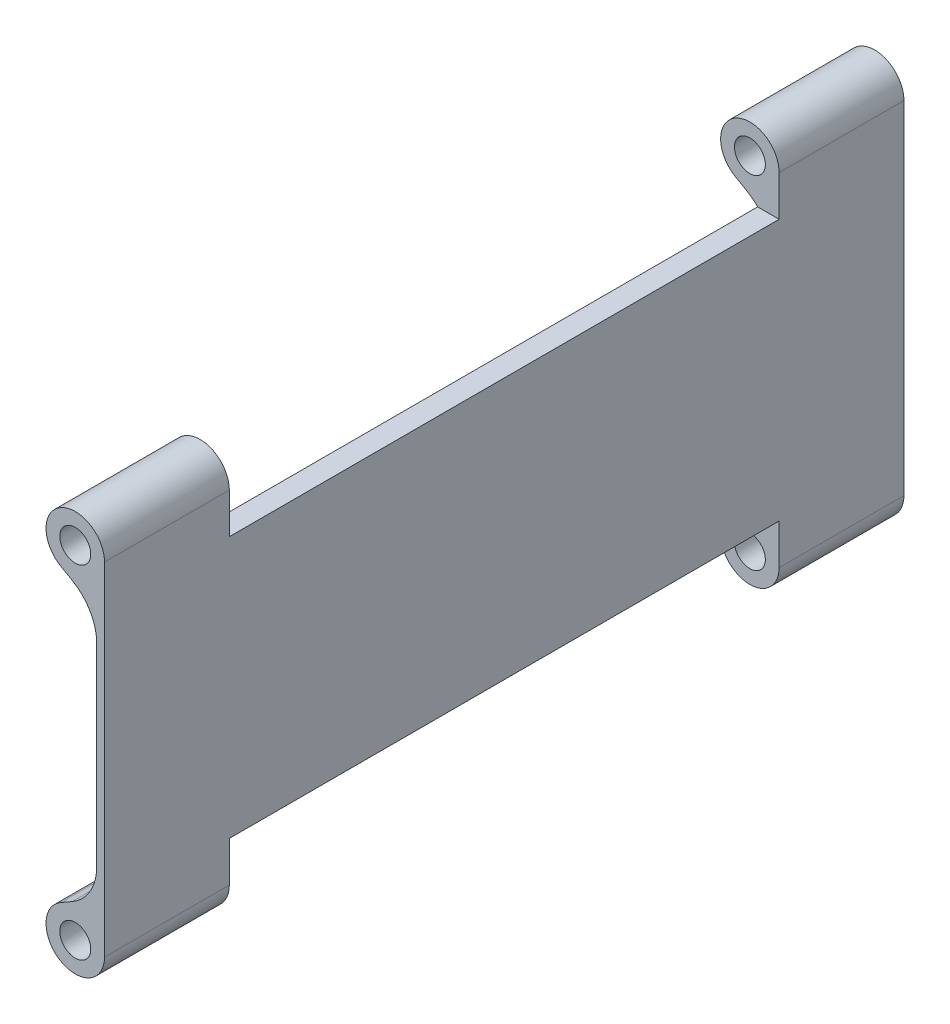
ISO-10303-21;
HEADER;
FILE_DESCRIPTION(('STEP AP214'),'2;1');
FILE_NAME('part.step','',(''),(''),'','','');
FILE_SCHEMA(('AUTOMOTIVE_DESIGN { 1 0 10303 214 1 1 1 1 }'));
ENDSEC;
DATA;
#1=APPLICATION_CONTEXT('core data for automotive mechanical design processes');
#2=APPLICATION_PROTOCOL_DEFINITION('international standard','automotive_design',2000,#1);
#3=PRODUCT_CONTEXT('',#1,'mechanical');
#4=PRODUCT('Part','Part','',(#3));
#5=PRODUCT_RELATED_PRODUCT_CATEGORY('part','',(#4));
#6=PRODUCT_DEFINITION_FORMATION('','',#4);
#7=PRODUCT_DEFINITION_CONTEXT('part definition',#1,'design');
#8=PRODUCT_DEFINITION('design','',#6,#7);
#9=PRODUCT_DEFINITION_SHAPE('','',#8);
#10=(LENGTH_UNIT() NAMED_UNIT(*) SI_UNIT(.MILLI.,.METRE.));
#11=(NAMED_UNIT(*) PLANE_ANGLE_UNIT() SI_UNIT($,.RADIAN.));
#12=(NAMED_UNIT(*) SI_UNIT($,.STERADIAN.) SOLID_ANGLE_UNIT());
#13=UNCERTAINTY_MEASURE_WITH_UNIT(LENGTH_MEASURE(1.E-05),#10,'distance_accuracy_value','');
#14=(GEOMETRIC_REPRESENTATION_CONTEXT(3) GLOBAL_UNCERTAINTY_ASSIGNED_CONTEXT((#13)) GLOBAL_UNIT_ASSIGNED_CONTEXT((#10,
#11,#12)) REPRESENTATION_CONTEXT('',''));
#15=CARTESIAN_POINT('',(0.,0.,0.));
#16=DIRECTION('',(0.,0.,1.));
#17=DIRECTION('',(1.,0.,0.));
#18=AXIS2_PLACEMENT_3D('',#15,#16,#17);
#19=CARTESIAN_POINT('',(-6.,35.09,-164.));
#20=DIRECTION('',(0.,0.,1.));
#21=DIRECTION('',(1.,0.,0.));
#22=AXIS2_PLACEMENT_3D('',#19,#20,#21);
#23=CYLINDRICAL_SURFACE('',#22,6.);
#24=DIRECTION('',(0.,0.,1.));
#25=VECTOR('',#24,1.);
#26=CARTESIAN_POINT('',(-8.98691390995378,29.8863142586697,-164.));
#27=LINE('',#26,#25);
#28=CARTESIAN_POINT('',(-8.98691390995378,29.8863142586697,-164.));
#29=VERTEX_POINT('',#28);
#30=CARTESIAN_POINT('',(-8.98691390995378,29.8863142586697,-138.395906153218));
#31=VERTEX_POINT('',#30);
#32=EDGE_CURVE('E280',#29,#31,#27,.T.);
#33=ORIENTED_EDGE('',*,*,#32,.T.);
#34=CARTESIAN_POINT('',(-6.,35.09,-138.395906153218));
#35=DIRECTION('',(0.,0.,-1.));
#36=DIRECTION('',(-1.,0.,0.));
#37=AXIS2_PLACEMENT_3D('',#34,#35,#36);
#38=CIRCLE('',#37,6.);
#39=CARTESIAN_POINT('',(0.,35.09,-138.395906153218));
#40=VERTEX_POINT('',#39);
#41=EDGE_CURVE('E194',#40,#31,#38,.F.);
#42=ORIENTED_EDGE('',*,*,#41,.F.);
#43=DIRECTION('',(0.,0.,1.));
#44=VECTOR('',#43,1.);
#45=CARTESIAN_POINT('',(0.,35.09,-164.));
#46=LINE('',#45,#44);
#47=CARTESIAN_POINT('',(0.,35.09,-164.));
#48=VERTEX_POINT('',#47);
#49=EDGE_CURVE('E268',#48,#40,#46,.T.);
#50=ORIENTED_EDGE('',*,*,#49,.F.);
#51=CARTESIAN_POINT('',(-6.,35.09,-164.));
#52=DIRECTION('',(0.,0.,1.));
#53=DIRECTION('',(1.,0.,0.));
#54=AXIS2_PLACEMENT_3D('',#51,#52,#53);
#55=CIRCLE('',#54,6.);
#56=EDGE_CURVE('E233',#48,#29,#55,.T.);
#57=ORIENTED_EDGE('',*,*,#56,.T.);
#58=EDGE_LOOP('',(#33,#42,#50,#57));
#59=FACE_BOUND('',#58,.T.);
#60=ADVANCED_FACE('F32',(#59),#23,.T.);
#61=CARTESIAN_POINT('',(-6.,-35.09,-164.));
#62=DIRECTION('',(0.,0.,1.));
#63=DIRECTION('',(1.,0.,0.));
#64=AXIS2_PLACEMENT_3D('',#61,#62,#63);
#65=CYLINDRICAL_SURFACE('',#64,6.);
#66=CARTESIAN_POINT('',(-6.,-35.09,-25.604093846782));
#67=DIRECTION('',(0.,0.,1.));
#68=DIRECTION('',(1.,0.,0.));
#69=AXIS2_PLACEMENT_3D('',#66,#67,#68);
#70=CIRCLE('',#69,6.);
#71=CARTESIAN_POINT('',(0.,-35.09,-25.604093846782));
#72=VERTEX_POINT('',#71);
#73=CARTESIAN_POINT('',(-8.98691390995378,-29.8863142586697,-25.604093846782));
#74=VERTEX_POINT('',#73);
#75=EDGE_CURVE('E215',#72,#74,#70,.F.);
#76=ORIENTED_EDGE('',*,*,#75,.F.);
#77=DIRECTION('',(0.,0.,1.));
#78=VECTOR('',#77,1.);
#79=CARTESIAN_POINT('',(0.,-35.09,-164.));
#80=LINE('',#79,#78);
#81=CARTESIAN_POINT('',(0.,-35.09,0.));
#82=VERTEX_POINT('',#81);
#83=EDGE_CURVE('E275',#72,#82,#80,.T.);
#84=ORIENTED_EDGE('',*,*,#83,.T.);
#85=CARTESIAN_POINT('',(-6.,-35.09,0.));
#86=DIRECTION('',(0.,0.,1.));
#87=DIRECTION('',(-1.,0.,0.));
#88=AXIS2_PLACEMENT_3D('',#85,#86,#87);
#89=CIRCLE('',#88,6.);
#90=CARTESIAN_POINT('',(-8.98691390995378,-29.8863142586697,0.));
#91=VERTEX_POINT('',#90);
#92=EDGE_CURVE('E263',#91,#82,#89,.T.);
#93=ORIENTED_EDGE('',*,*,#92,.F.);
#94=DIRECTION('',(0.,0.,1.));
#95=VECTOR('',#94,1.);
#96=CARTESIAN_POINT('',(-8.98691390995378,-29.8863142586697,-164.));
#97=LINE('',#96,#95);
#98=EDGE_CURVE('E279',#74,#91,#97,.T.);
#99=ORIENTED_EDGE('',*,*,#98,.F.);
#100=EDGE_LOOP('',(#76,#84,#93,#99));
#101=FACE_BOUND('',#100,.T.);
#102=ADVANCED_FACE('F332',(#101),#65,.T.);
#103=CARTESIAN_POINT('',(-1.59999999999999,-25.646228095505,-164.));
#104=DIRECTION('',(-0.497818984992298,0.867280956888389,0.));
#105=DIRECTION('',(-0.867280956888389,-0.497818984992298,0.));
#106=AXIS2_PLACEMENT_3D('',#103,#104,#105);
#107=PLANE('',#106);
#108=DIRECTION('',(0.867280956888389,0.497818984992298,0.));
#109=VECTOR('',#108,1.);
#110=CARTESIAN_POINT('',(-1.59999999999999,-25.646228095505,-25.604093846782));
#111=LINE('',#110,#109);
#112=CARTESIAN_POINT('',(-6.62181015007702,-28.5287454756913,-25.604093846782));
#113=VERTEX_POINT('',#112);
#114=EDGE_CURVE('E213',#74,#113,#111,.T.);
#115=ORIENTED_EDGE('',*,*,#114,.F.);
#116=ORIENTED_EDGE('',*,*,#98,.T.);
#117=DIRECTION('',(-0.867280956888388,-0.497818984992297,0.));
#118=VECTOR('',#117,1.);
#119=CARTESIAN_POINT('',(-1.59999999999999,-25.646228095505,0.));
#120=LINE('',#119,#118);
#121=CARTESIAN_POINT('',(-6.62181015007702,-28.5287454756913,0.));
#122=VERTEX_POINT('',#121);
#123=EDGE_CURVE('E260',#122,#91,#120,.T.);
#124=ORIENTED_EDGE('',*,*,#123,.F.);
#125=DIRECTION('',(0.,0.,1.));
#126=VECTOR('',#125,1.);
#127=CARTESIAN_POINT('',(-6.62181015007702,-28.5287454756913,-164.));
#128=LINE('',#127,#126);
#129=EDGE_CURVE('E288',#122,#113,#128,.F.);
#130=ORIENTED_EDGE('',*,*,#129,.T.);
#131=EDGE_LOOP('',(#115,#116,#124,#130));
#132=FACE_BOUND('',#131,.T.);
#133=ADVANCED_FACE('F328',(#132),#107,.T.);
#134=CARTESIAN_POINT('',(-1.59999999999999,25.646228095505,-164.));
#135=DIRECTION('',(-0.497818984992298,-0.867280956888389,0.));
#136=DIRECTION('',(0.867280956888389,-0.497818984992298,0.));
#137=AXIS2_PLACEMENT_3D('',#134,#135,#136);
#138=PLANE('',#137);
#139=DIRECTION('',(-0.867280956888389,0.497818984992298,0.));
#140=VECTOR('',#139,1.);
#141=CARTESIAN_POINT('',(-1.59999999999998,25.646228095505,-25.604093846782));
#142=LINE('',#141,#140);
#143=CARTESIAN_POINT('',(-6.62181015007702,28.5287454756913,-25.604093846782));
#144=VERTEX_POINT('',#143);
#145=CARTESIAN_POINT('',(-8.98691390995378,29.8863142586697,-25.604093846782));
#146=VERTEX_POINT('',#145);
#147=EDGE_CURVE('E199',#144,#146,#142,.T.);
#148=ORIENTED_EDGE('',*,*,#147,.F.);
#149=DIRECTION('',(0.,0.,1.));
#150=VECTOR('',#149,1.);
#151=CARTESIAN_POINT('',(-6.62181015007702,28.5287454756913,0.));
#152=LINE('',#151,#150);
#153=CARTESIAN_POINT('',(-6.62181015007702,28.5287454756913,0.));
#154=VERTEX_POINT('',#153);
#155=EDGE_CURVE('E291',#144,#154,#152,.T.);
#156=ORIENTED_EDGE('',*,*,#155,.T.);
#157=DIRECTION('',(0.867280956888388,-0.497818984992297,0.));
#158=VECTOR('',#157,1.);
#159=CARTESIAN_POINT('',(-1.59999999999999,25.646228095505,0.));
#160=LINE('',#159,#158);
#161=CARTESIAN_POINT('',(-8.98691390995378,29.8863142586697,0.));
#162=VERTEX_POINT('',#161);
#163=EDGE_CURVE('E254',#162,#154,#160,.T.);
#164=ORIENTED_EDGE('',*,*,#163,.F.);
#165=EDGE_CURVE('E251',#146,#162,#27,.T.);
#166=ORIENTED_EDGE('',*,*,#165,.F.);
#167=EDGE_LOOP('',(#148,#156,#164,#166));
#168=FACE_BOUND('',#167,.T.);
#169=ADVANCED_FACE('F346',(#168),#138,.T.);
#170=CARTESIAN_POINT('',(-6.,35.09,-164.));
#171=DIRECTION('',(0.,0.,1.));
#172=DIRECTION('',(1.,0.,0.));
#173=AXIS2_PLACEMENT_3D('',#170,#171,#172);
#174=CYLINDRICAL_SURFACE('',#173,3.175);
#175=CARTESIAN_POINT('',(-6.,35.09,-25.604093846782));
#176=DIRECTION('',(0.,0.,1.));
#177=DIRECTION('',(0.,-1.,0.));
#178=AXIS2_PLACEMENT_3D('',#175,#176,#177);
#179=CIRCLE('',#178,3.175);
#180=CARTESIAN_POINT('',(-6.,31.915,-25.604093846782));
#181=VERTEX_POINT('',#180);
#182=EDGE_CURVE('E202',#181,#181,#179,.F.);
#183=ORIENTED_EDGE('',*,*,#182,.T.);
#184=EDGE_LOOP('',(#183));
#185=FACE_BOUND('',#184,.T.);
#186=CARTESIAN_POINT('',(-6.,35.09,0.));
#187=DIRECTION('',(0.,0.,1.));
#188=DIRECTION('',(1.,0.,0.));
#189=AXIS2_PLACEMENT_3D('',#186,#187,#188);
#190=CIRCLE('',#189,3.175);
#191=CARTESIAN_POINT('',(-2.82499999999999,35.09,0.));
#192=VERTEX_POINT('',#191);
#193=EDGE_CURVE('E224',#192,#192,#190,.T.);
#194=ORIENTED_EDGE('',*,*,#193,.T.);
#195=EDGE_LOOP('',(#194));
#196=FACE_BOUND('',#195,.T.);
#197=ADVANCED_FACE('F392',(#185,#196),#174,.F.);
#198=CARTESIAN_POINT('',(-6.,-35.09,-164.));
#199=DIRECTION('',(0.,0.,1.));
#200=DIRECTION('',(1.,0.,0.));
#201=AXIS2_PLACEMENT_3D('',#198,#199,#200);
#202=CYLINDRICAL_SURFACE('',#201,3.175);
#203=CARTESIAN_POINT('',(-6.,-35.09,-25.604093846782));
#204=DIRECTION('',(0.,0.,1.));
#205=DIRECTION('',(1.,0.,0.));
#206=AXIS2_PLACEMENT_3D('',#203,#204,#205);
#207=CIRCLE('',#206,3.175);
#208=CARTESIAN_POINT('',(-2.82499999999999,-35.09,-25.604093846782));
#209=VERTEX_POINT('',#208);
#210=EDGE_CURVE('E217',#209,#209,#207,.F.);
#211=ORIENTED_EDGE('',*,*,#210,.T.);
#212=EDGE_LOOP('',(#211));
#213=FACE_BOUND('',#212,.T.);
#214=CARTESIAN_POINT('',(-6.,-35.09,0.));
#215=DIRECTION('',(0.,0.,1.));
#216=DIRECTION('',(-1.,0.,0.));
#217=AXIS2_PLACEMENT_3D('',#214,#215,#216);
#218=CIRCLE('',#217,3.175);
#219=CARTESIAN_POINT('',(-9.175,-35.09,0.));
#220=VERTEX_POINT('',#219);
#221=EDGE_CURVE('E220',#220,#220,#218,.T.);
#222=ORIENTED_EDGE('',*,*,#221,.T.);
#223=EDGE_LOOP('',(#222));
#224=FACE_BOUND('',#223,.T.);
#225=ADVANCED_FACE('F399',(#213,#224),#202,.F.);
#226=CARTESIAN_POINT('',(-6.,35.09,-25.604093846782));
#227=DIRECTION('',(0.,0.,1.));
#228=DIRECTION('',(0.,-1.,0.));
#229=AXIS2_PLACEMENT_3D('',#226,#227,#228);
#230=CIRCLE('',#229,6.);
#231=CARTESIAN_POINT('',(0.,35.09,-25.604093846782));
#232=VERTEX_POINT('',#231);
#233=EDGE_CURVE('E164',#146,#232,#230,.F.);
#234=ORIENTED_EDGE('',*,*,#233,.F.);
#235=ORIENTED_EDGE('',*,*,#165,.T.);
#236=CARTESIAN_POINT('',(-6.,35.09,0.));
#237=DIRECTION('',(0.,0.,1.));
#238=DIRECTION('',(1.,0.,0.));
#239=AXIS2_PLACEMENT_3D('',#236,#237,#238);
#240=CIRCLE('',#239,6.);
#241=CARTESIAN_POINT('',(0.,35.09,0.));
#242=VERTEX_POINT('',#241);
#243=EDGE_CURVE('E230',#242,#162,#240,.T.);
#244=ORIENTED_EDGE('',*,*,#243,.F.);
#245=EDGE_CURVE('E271',#232,#242,#46,.T.);
#246=ORIENTED_EDGE('',*,*,#245,.F.);
#247=EDGE_LOOP('',(#234,#235,#244,#246));
#248=FACE_BOUND('',#247,.T.);
#249=ADVANCED_FACE('F339',(#248),#23,.T.);
#250=CARTESIAN_POINT('',(0.,35.09,-164.));
#251=DIRECTION('',(1.,0.,0.));
#252=DIRECTION('',(0.,0.,-1.));
#253=AXIS2_PLACEMENT_3D('',#250,#251,#252);
#254=PLANE('',#253);
#255=DIRECTION('',(0.,-1.,0.));
#256=VECTOR('',#255,1.);
#257=CARTESIAN_POINT('',(0.,44.9478454916756,-25.604093846782));
#258=LINE('',#257,#256);
#259=CARTESIAN_POINT('',(0.,26.8024105782486,-25.604093846782));
#260=VERTEX_POINT('',#259);
#261=EDGE_CURVE('E157',#232,#260,#258,.T.);
#262=ORIENTED_EDGE('',*,*,#261,.F.);
#263=ORIENTED_EDGE('',*,*,#245,.T.);
#264=DIRECTION('',(0.,1.,0.));
#265=VECTOR('',#264,1.);
#266=CARTESIAN_POINT('',(0.,35.09,0.));
#267=LINE('',#266,#265);
#268=EDGE_CURVE('E237',#82,#242,#267,.T.);
#269=ORIENTED_EDGE('',*,*,#268,.F.);
#270=ORIENTED_EDGE('',*,*,#83,.F.);
#271=DIRECTION('',(0.,-1.,0.));
#272=VECTOR('',#271,1.);
#273=CARTESIAN_POINT('',(0.,-44.9478454916756,-25.604093846782));
#274=LINE('',#273,#272);
#275=CARTESIAN_POINT('',(0.,-26.8024105782486,-25.604093846782));
#276=VERTEX_POINT('',#275);
#277=EDGE_CURVE('E189',#276,#72,#274,.T.);
#278=ORIENTED_EDGE('',*,*,#277,.F.);
#279=DIRECTION('',(0.,0.,1.));
#280=VECTOR('',#279,1.);
#281=CARTESIAN_POINT('',(0.,-26.8024105782486,-25.604093846782));
#282=LINE('',#281,#280);
#283=CARTESIAN_POINT('',(0.,-26.8024105782486,-138.395906153218));
#284=VERTEX_POINT('',#283);
#285=EDGE_CURVE('E186',#284,#276,#282,.T.);
#286=ORIENTED_EDGE('',*,*,#285,.F.);
#287=DIRECTION('',(0.,1.,0.));
#288=VECTOR('',#287,1.);
#289=CARTESIAN_POINT('',(0.,-44.9478454916756,-138.395906153218));
#290=LINE('',#289,#288);
#291=CARTESIAN_POINT('',(0.,-35.09,-138.395906153218));
#292=VERTEX_POINT('',#291);
#293=EDGE_CURVE('E184',#292,#284,#290,.T.);
#294=ORIENTED_EDGE('',*,*,#293,.F.);
#295=CARTESIAN_POINT('',(0.,-35.09,-164.));
#296=VERTEX_POINT('',#295);
#297=EDGE_CURVE('E272',#296,#292,#80,.T.);
#298=ORIENTED_EDGE('',*,*,#297,.F.);
#299=DIRECTION('',(0.,1.,0.));
#300=VECTOR('',#299,1.);
#301=CARTESIAN_POINT('',(0.,35.09,-164.));
#302=LINE('',#301,#300);
#303=EDGE_CURVE('E248',#296,#48,#302,.T.);
#304=ORIENTED_EDGE('',*,*,#303,.T.);
#305=ORIENTED_EDGE('',*,*,#49,.T.);
#306=DIRECTION('',(0.,1.,0.));
#307=VECTOR('',#306,1.);
#308=CARTESIAN_POINT('',(0.,44.9478454916756,-138.395906153218));
#309=LINE('',#308,#307);
#310=CARTESIAN_POINT('',(0.,26.8024105782486,-138.395906153218));
#311=VERTEX_POINT('',#310);
#312=EDGE_CURVE('E175',#311,#40,#309,.T.);
#313=ORIENTED_EDGE('',*,*,#312,.F.);
#314=DIRECTION('',(0.,0.,-1.));
#315=VECTOR('',#314,1.);
#316=CARTESIAN_POINT('',(0.,26.8024105782486,-25.604093846782));
#317=LINE('',#316,#315);
#318=EDGE_CURVE('E168',#260,#311,#317,.T.);
#319=ORIENTED_EDGE('',*,*,#318,.F.);
#320=EDGE_LOOP('',(#262,#263,#269,#270,#278,#286,#294,#298,#304,#305,#313,#319));
#321=FACE_BOUND('',#320,.T.);
#322=ADVANCED_FACE('F177',(#321),#254,.T.);
#323=CARTESIAN_POINT('',(-6.,-35.09,-138.395906153218));
#324=DIRECTION('',(0.,0.,-1.));
#325=DIRECTION('',(-1.,0.,0.));
#326=AXIS2_PLACEMENT_3D('',#323,#324,#325);
#327=CIRCLE('',#326,6.);
#328=CARTESIAN_POINT('',(-8.98691390995378,-29.8863142586697,-138.395906153218));
#329=VERTEX_POINT('',#328);
#330=EDGE_CURVE('E208',#329,#292,#327,.F.);
#331=ORIENTED_EDGE('',*,*,#330,.F.);
#332=CARTESIAN_POINT('',(-8.98691390995378,-29.8863142586697,-164.));
#333=VERTEX_POINT('',#332);
#334=EDGE_CURVE('E276',#333,#329,#97,.T.);
#335=ORIENTED_EDGE('',*,*,#334,.F.);
#336=CARTESIAN_POINT('',(-6.,-35.09,-164.));
#337=DIRECTION('',(0.,0.,1.));
#338=DIRECTION('',(-1.,0.,0.));
#339=AXIS2_PLACEMENT_3D('',#336,#337,#338);
#340=CIRCLE('',#339,6.);
#341=EDGE_CURVE('E245',#333,#296,#340,.T.);
#342=ORIENTED_EDGE('',*,*,#341,.T.);
#343=ORIENTED_EDGE('',*,*,#297,.T.);
#344=EDGE_LOOP('',(#331,#335,#342,#343));
#345=FACE_BOUND('',#344,.T.);
#346=ADVANCED_FACE('F371',(#345),#65,.T.);
#347=DIRECTION('',(-0.867280956888389,-0.497818984992298,0.));
#348=VECTOR('',#347,1.);
#349=CARTESIAN_POINT('',(-1.59999999999999,-25.646228095505,-138.395906153218));
#350=LINE('',#349,#348);
#351=CARTESIAN_POINT('',(-6.62181015007702,-28.5287454756913,-138.395906153218));
#352=VERTEX_POINT('',#351);
#353=EDGE_CURVE('E205',#352,#329,#350,.T.);
#354=ORIENTED_EDGE('',*,*,#353,.F.);
#355=CARTESIAN_POINT('',(-6.62181015007702,-28.5287454756913,-164.));
#356=VERTEX_POINT('',#355);
#357=EDGE_CURVE('E287',#352,#356,#128,.F.);
#358=ORIENTED_EDGE('',*,*,#357,.T.);
#359=DIRECTION('',(-0.867280956888388,-0.497818984992297,0.));
#360=VECTOR('',#359,1.);
#361=CARTESIAN_POINT('',(-1.59999999999999,-25.646228095505,-164.));
#362=LINE('',#361,#360);
#363=EDGE_CURVE('E243',#356,#333,#362,.T.);
#364=ORIENTED_EDGE('',*,*,#363,.T.);
#365=ORIENTED_EDGE('',*,*,#334,.T.);
#366=EDGE_LOOP('',(#354,#358,#364,#365));
#367=FACE_BOUND('',#366,.T.);
#368=ADVANCED_FACE('F365',(#367),#107,.T.);
#369=CARTESIAN_POINT('',(-1.59999999999999,25.646228095505,-164.));
#370=DIRECTION('',(-1.,0.,0.));
#371=DIRECTION('',(0.,0.,1.));
#372=AXIS2_PLACEMENT_3D('',#369,#370,#371);
#373=PLANE('',#372);
#374=DIRECTION('',(0.,-1.,0.));
#375=VECTOR('',#374,1.);
#376=CARTESIAN_POINT('',(-1.59999999999999,25.646228095505,-164.));
#377=LINE('',#376,#375);
#378=CARTESIAN_POINT('',(-1.59999999999999,19.8559359068074,-164.));
#379=VERTEX_POINT('',#378);
#380=CARTESIAN_POINT('',(-1.59999999999999,-19.8559359068074,-164.));
#381=VERTEX_POINT('',#380);
#382=EDGE_CURVE('E240',#379,#381,#377,.T.);
#383=ORIENTED_EDGE('',*,*,#382,.T.);
#384=DIRECTION('',(0.,0.,1.));
#385=VECTOR('',#384,1.);
#386=CARTESIAN_POINT('',(-1.59999999999999,-19.8559359068074,0.));
#387=LINE('',#386,#385);
#388=CARTESIAN_POINT('',(-1.59999999999999,-19.8559359068074,0.));
#389=VERTEX_POINT('',#388);
#390=EDGE_CURVE('E284',#381,#389,#387,.T.);
#391=ORIENTED_EDGE('',*,*,#390,.T.);
#392=DIRECTION('',(0.,-1.,0.));
#393=VECTOR('',#392,1.);
#394=CARTESIAN_POINT('',(-1.59999999999999,25.646228095505,0.));
#395=LINE('',#394,#393);
#396=CARTESIAN_POINT('',(-1.59999999999999,19.8559359068074,0.));
#397=VERTEX_POINT('',#396);
#398=EDGE_CURVE('E257',#397,#389,#395,.T.);
#399=ORIENTED_EDGE('',*,*,#398,.F.);
#400=DIRECTION('',(0.,0.,1.));
#401=VECTOR('',#400,1.);
#402=CARTESIAN_POINT('',(-1.59999999999999,19.8559359068074,-164.));
#403=LINE('',#402,#401);
#404=EDGE_CURVE('E270',#397,#379,#403,.F.);
#405=ORIENTED_EDGE('',*,*,#404,.T.);
#406=EDGE_LOOP('',(#383,#391,#399,#405));
#407=FACE_BOUND('',#406,.T.);
#408=ADVANCED_FACE('F354',(#407),#373,.T.);
#409=DIRECTION('',(0.867280956888389,-0.497818984992298,0.));
#410=VECTOR('',#409,1.);
#411=CARTESIAN_POINT('',(-1.59999999999999,25.646228095505,-138.395906153218));
#412=LINE('',#411,#410);
#413=CARTESIAN_POINT('',(-6.62181015007702,28.5287454756913,-138.395906153218));
#414=VERTEX_POINT('',#413);
#415=EDGE_CURVE('E182',#31,#414,#412,.T.);
#416=ORIENTED_EDGE('',*,*,#415,.F.);
#417=ORIENTED_EDGE('',*,*,#32,.F.);
#418=DIRECTION('',(0.867280956888388,-0.497818984992297,0.));
#419=VECTOR('',#418,1.);
#420=CARTESIAN_POINT('',(-1.59999999999999,25.646228095505,-164.));
#421=LINE('',#420,#419);
#422=CARTESIAN_POINT('',(-6.62181015007702,28.5287454756913,-164.));
#423=VERTEX_POINT('',#422);
#424=EDGE_CURVE('E236',#29,#423,#421,.T.);
#425=ORIENTED_EDGE('',*,*,#424,.T.);
#426=EDGE_CURVE('E292',#423,#414,#152,.T.);
#427=ORIENTED_EDGE('',*,*,#426,.T.);
#428=EDGE_LOOP('',(#416,#417,#425,#427));
#429=FACE_BOUND('',#428,.T.);
#430=ADVANCED_FACE('F380',(#429),#138,.T.);
#431=CARTESIAN_POINT('',(-6.,35.09,-164.));
#432=DIRECTION('',(0.,0.,1.));
#433=DIRECTION('',(1.,0.,0.));
#434=AXIS2_PLACEMENT_3D('',#431,#432,#433);
#435=PLANE('',#434);
#436=CARTESIAN_POINT('',(-6.,-35.09,-164.));
#437=DIRECTION('',(0.,0.,1.));
#438=DIRECTION('',(-1.,0.,0.));
#439=AXIS2_PLACEMENT_3D('',#436,#437,#438);
#440=CIRCLE('',#439,3.175);
#441=CARTESIAN_POINT('',(-9.175,-35.09,-164.));
#442=VERTEX_POINT('',#441);
#443=EDGE_CURVE('E221',#442,#442,#440,.T.);
#444=ORIENTED_EDGE('',*,*,#443,.T.);
#445=EDGE_LOOP('',(#444));
#446=FACE_BOUND('',#445,.T.);
#447=CARTESIAN_POINT('',(-6.,35.09,-164.));
#448=DIRECTION('',(0.,0.,1.));
#449=DIRECTION('',(1.,0.,0.));
#450=AXIS2_PLACEMENT_3D('',#447,#448,#449);
#451=CIRCLE('',#450,3.175);
#452=CARTESIAN_POINT('',(-2.82499999999999,35.09,-164.));
#453=VERTEX_POINT('',#452);
#454=EDGE_CURVE('E227',#453,#453,#451,.T.);
#455=ORIENTED_EDGE('',*,*,#454,.T.);
#456=EDGE_LOOP('',(#455));
#457=FACE_BOUND('',#456,.T.);
#458=ORIENTED_EDGE('',*,*,#56,.F.);
#459=ORIENTED_EDGE('',*,*,#303,.F.);
#460=ORIENTED_EDGE('',*,*,#341,.F.);
#461=ORIENTED_EDGE('',*,*,#363,.F.);
#462=CARTESIAN_POINT('',(-11.6,-19.8559359068074,-164.));
#463=DIRECTION('',(0.,0.,1.));
#464=DIRECTION('',(1.,0.,0.));
#465=AXIS2_PLACEMENT_3D('',#462,#463,#464);
#466=CIRCLE('',#465,10.);
#467=EDGE_CURVE('E297',#356,#381,#466,.T.);
#468=ORIENTED_EDGE('',*,*,#467,.T.);
#469=ORIENTED_EDGE('',*,*,#382,.F.);
#470=CARTESIAN_POINT('',(-11.6,19.8559359068074,-164.));
#471=DIRECTION('',(0.,0.,1.));
#472=DIRECTION('',(1.,0.,0.));
#473=AXIS2_PLACEMENT_3D('',#470,#471,#472);
#474=CIRCLE('',#473,10.);
#475=EDGE_CURVE('E301',#379,#423,#474,.T.);
#476=ORIENTED_EDGE('',*,*,#475,.T.);
#477=ORIENTED_EDGE('',*,*,#424,.F.);
#478=EDGE_LOOP('',(#458,#459,#460,#461,#468,#469,#476,#477));
#479=FACE_BOUND('',#478,.T.);
#480=ADVANCED_FACE('F358',(#446,#457,#479),#435,.F.);
#481=CARTESIAN_POINT('',(-6.,35.09,0.));
#482=DIRECTION('',(0.,0.,1.));
#483=DIRECTION('',(1.,0.,0.));
#484=AXIS2_PLACEMENT_3D('',#481,#482,#483);
#485=PLANE('',#484);
#486=ORIENTED_EDGE('',*,*,#221,.F.);
#487=EDGE_LOOP('',(#486));
#488=FACE_BOUND('',#487,.T.);
#489=ORIENTED_EDGE('',*,*,#193,.F.);
#490=EDGE_LOOP('',(#489));
#491=FACE_BOUND('',#490,.T.);
#492=ORIENTED_EDGE('',*,*,#243,.T.);
#493=ORIENTED_EDGE('',*,*,#163,.T.);
#494=CARTESIAN_POINT('',(-11.6,19.8559359068074,0.));
#495=DIRECTION('',(0.,0.,1.));
#496=DIRECTION('',(1.,0.,0.));
#497=AXIS2_PLACEMENT_3D('',#494,#495,#496);
#498=CIRCLE('',#497,10.);
#499=EDGE_CURVE('E299',#154,#397,#498,.F.);
#500=ORIENTED_EDGE('',*,*,#499,.T.);
#501=ORIENTED_EDGE('',*,*,#398,.T.);
#502=CARTESIAN_POINT('',(-11.6,-19.8559359068074,0.));
#503=DIRECTION('',(0.,0.,1.));
#504=DIRECTION('',(1.,0.,0.));
#505=AXIS2_PLACEMENT_3D('',#502,#503,#504);
#506=CIRCLE('',#505,10.);
#507=EDGE_CURVE('E295',#389,#122,#506,.F.);
#508=ORIENTED_EDGE('',*,*,#507,.T.);
#509=ORIENTED_EDGE('',*,*,#123,.T.);
#510=ORIENTED_EDGE('',*,*,#92,.T.);
#511=ORIENTED_EDGE('',*,*,#268,.T.);
#512=EDGE_LOOP('',(#492,#493,#500,#501,#508,#509,#510,#511));
#513=FACE_BOUND('',#512,.T.);
#514=ADVANCED_FACE('F336',(#488,#491,#513),#485,.T.);
#515=CARTESIAN_POINT('',(-6.,35.09,-138.395906153218));
#516=DIRECTION('',(0.,0.,-1.));
#517=DIRECTION('',(-1.,0.,0.));
#518=AXIS2_PLACEMENT_3D('',#515,#516,#517);
#519=CIRCLE('',#518,3.175);
#520=CARTESIAN_POINT('',(-9.175,35.09,-138.395906153218));
#521=VERTEX_POINT('',#520);
#522=EDGE_CURVE('E196',#521,#521,#519,.F.);
#523=ORIENTED_EDGE('',*,*,#522,.T.);
#524=EDGE_LOOP('',(#523));
#525=FACE_BOUND('',#524,.T.);
#526=ORIENTED_EDGE('',*,*,#454,.F.);
#527=EDGE_LOOP('',(#526));
#528=FACE_BOUND('',#527,.T.);
#529=ADVANCED_FACE('F413',(#525,#528),#174,.F.);
#530=CARTESIAN_POINT('',(-6.,-35.09,-138.395906153218));
#531=DIRECTION('',(0.,0.,-1.));
#532=DIRECTION('',(-1.,0.,0.));
#533=AXIS2_PLACEMENT_3D('',#530,#531,#532);
#534=CIRCLE('',#533,3.175);
#535=CARTESIAN_POINT('',(-9.175,-35.09,-138.395906153218));
#536=VERTEX_POINT('',#535);
#537=EDGE_CURVE('E210',#536,#536,#534,.F.);
#538=ORIENTED_EDGE('',*,*,#537,.T.);
#539=EDGE_LOOP('',(#538));
#540=FACE_BOUND('',#539,.T.);
#541=ORIENTED_EDGE('',*,*,#443,.F.);
#542=EDGE_LOOP('',(#541));
#543=FACE_BOUND('',#542,.T.);
#544=ADVANCED_FACE('F407',(#540,#543),#202,.F.);
#545=CARTESIAN_POINT('',(-11.6,-19.8559359068074,-164.));
#546=DIRECTION('',(0.,0.,-1.));
#547=DIRECTION('',(-1.,0.,0.));
#548=AXIS2_PLACEMENT_3D('',#545,#546,#547);
#549=CYLINDRICAL_SURFACE('',#548,10.);
#550=DIRECTION('',(0.,0.,-1.));
#551=VECTOR('',#550,1.);
#552=CARTESIAN_POINT('',(-4.40649670612254,-26.8024105782486,-164.));
#553=LINE('',#552,#551);
#554=CARTESIAN_POINT('',(-4.40649670612254,-26.8024105782486,-138.395906153218));
#555=VERTEX_POINT('',#554);
#556=CARTESIAN_POINT('',(-4.40649670612254,-26.8024105782486,-25.604093846782));
#557=VERTEX_POINT('',#556);
#558=EDGE_CURVE('E40',#555,#557,#553,.F.);
#559=ORIENTED_EDGE('',*,*,#558,.T.);
#560=CARTESIAN_POINT('',(-11.6,-19.8559359068074,-25.604093846782));
#561=DIRECTION('',(0.,0.,1.));
#562=DIRECTION('',(1.,0.,0.));
#563=AXIS2_PLACEMENT_3D('',#560,#561,#562);
#564=CIRCLE('',#563,10.);
#565=EDGE_CURVE('E11',#557,#113,#564,.F.);
#566=ORIENTED_EDGE('',*,*,#565,.T.);
#567=ORIENTED_EDGE('',*,*,#129,.F.);
#568=ORIENTED_EDGE('',*,*,#507,.F.);
#569=ORIENTED_EDGE('',*,*,#390,.F.);
#570=ORIENTED_EDGE('',*,*,#467,.F.);
#571=ORIENTED_EDGE('',*,*,#357,.F.);
#572=CARTESIAN_POINT('',(-11.6,-19.8559359068074,-138.395906153218));
#573=DIRECTION('',(0.,0.,-1.));
#574=DIRECTION('',(-1.,0.,0.));
#575=AXIS2_PLACEMENT_3D('',#572,#573,#574);
#576=CIRCLE('',#575,10.);
#577=EDGE_CURVE('E309',#352,#555,#576,.F.);
#578=ORIENTED_EDGE('',*,*,#577,.T.);
#579=EDGE_LOOP('',(#559,#566,#567,#568,#569,#570,#571,#578));
#580=FACE_BOUND('',#579,.T.);
#581=ADVANCED_FACE('F313',(#580),#549,.F.);
#582=CARTESIAN_POINT('',(-11.6,19.8559359068074,-164.));
#583=DIRECTION('',(0.,0.,-1.));
#584=DIRECTION('',(-1.,0.,0.));
#585=AXIS2_PLACEMENT_3D('',#582,#583,#584);
#586=CYLINDRICAL_SURFACE('',#585,10.);
#587=ORIENTED_EDGE('',*,*,#155,.F.);
#588=CARTESIAN_POINT('',(-11.6,19.8559359068074,-25.604093846782));
#589=DIRECTION('',(0.,0.,1.));
#590=DIRECTION('',(0.,-1.,0.));
#591=AXIS2_PLACEMENT_3D('',#588,#589,#590);
#592=CIRCLE('',#591,10.);
#593=CARTESIAN_POINT('',(-4.40649670612255,26.8024105782486,-25.604093846782));
#594=VERTEX_POINT('',#593);
#595=EDGE_CURVE('E307',#144,#594,#592,.F.);
#596=ORIENTED_EDGE('',*,*,#595,.T.);
#597=DIRECTION('',(0.,0.,-1.));
#598=VECTOR('',#597,1.);
#599=CARTESIAN_POINT('',(-4.40649670612255,26.8024105782486,-164.));
#600=LINE('',#599,#598);
#601=CARTESIAN_POINT('',(-4.40649670612255,26.8024105782486,-138.395906153218));
#602=VERTEX_POINT('',#601);
#603=EDGE_CURVE('E174',#594,#602,#600,.T.);
#604=ORIENTED_EDGE('',*,*,#603,.T.);
#605=CARTESIAN_POINT('',(-11.6,19.8559359068074,-138.395906153218));
#606=DIRECTION('',(0.,0.,-1.));
#607=DIRECTION('',(-1.,0.,0.));
#608=AXIS2_PLACEMENT_3D('',#605,#606,#607);
#609=CIRCLE('',#608,10.);
#610=EDGE_CURVE('E304',#602,#414,#609,.F.);
#611=ORIENTED_EDGE('',*,*,#610,.T.);
#612=ORIENTED_EDGE('',*,*,#426,.F.);
#613=ORIENTED_EDGE('',*,*,#475,.F.);
#614=ORIENTED_EDGE('',*,*,#404,.F.);
#615=ORIENTED_EDGE('',*,*,#499,.F.);
#616=EDGE_LOOP('',(#587,#596,#604,#611,#612,#613,#614,#615));
#617=FACE_BOUND('',#616,.T.);
#618=ADVANCED_FACE('F34',(#617),#586,.F.);
#619=CARTESIAN_POINT('',(-12.,44.9478454916756,-25.604093846782));
#620=DIRECTION('',(0.,0.,1.));
#621=DIRECTION('',(0.,-1.,0.));
#622=AXIS2_PLACEMENT_3D('',#619,#620,#621);
#623=PLANE('',#622);
#624=ORIENTED_EDGE('',*,*,#233,.T.);
#625=ORIENTED_EDGE('',*,*,#261,.T.);
#626=DIRECTION('',(1.,0.,0.));
#627=VECTOR('',#626,1.);
#628=CARTESIAN_POINT('',(-12.,26.8024105782486,-25.604093846782));
#629=LINE('',#628,#627);
#630=EDGE_CURVE('E161',#594,#260,#629,.T.);
#631=ORIENTED_EDGE('',*,*,#630,.F.);
#632=ORIENTED_EDGE('',*,*,#595,.F.);
#633=ORIENTED_EDGE('',*,*,#147,.T.);
#634=EDGE_LOOP('',(#624,#625,#631,#632,#633));
#635=FACE_BOUND('',#634,.T.);
#636=ORIENTED_EDGE('',*,*,#182,.F.);
#637=EDGE_LOOP('',(#636));
#638=FACE_BOUND('',#637,.T.);
#639=ADVANCED_FACE('F159',(#635,#638),#623,.F.);
#640=CARTESIAN_POINT('',(-12.,44.9478454916756,-138.395906153218));
#641=DIRECTION('',(0.,0.,-1.));
#642=DIRECTION('',(-1.,0.,0.));
#643=AXIS2_PLACEMENT_3D('',#640,#641,#642);
#644=PLANE('',#643);
#645=ORIENTED_EDGE('',*,*,#41,.T.);
#646=ORIENTED_EDGE('',*,*,#415,.T.);
#647=ORIENTED_EDGE('',*,*,#610,.F.);
#648=DIRECTION('',(1.,0.,0.));
#649=VECTOR('',#648,1.);
#650=CARTESIAN_POINT('',(-12.,26.8024105782486,-138.395906153218));
#651=LINE('',#650,#649);
#652=EDGE_CURVE('E55',#602,#311,#651,.T.);
#653=ORIENTED_EDGE('',*,*,#652,.T.);
#654=ORIENTED_EDGE('',*,*,#312,.T.);
#655=EDGE_LOOP('',(#645,#646,#647,#653,#654));
#656=FACE_BOUND('',#655,.T.);
#657=ORIENTED_EDGE('',*,*,#522,.F.);
#658=EDGE_LOOP('',(#657));
#659=FACE_BOUND('',#658,.T.);
#660=ADVANCED_FACE('F377',(#656,#659),#644,.F.);
#661=CARTESIAN_POINT('',(-12.,26.8024105782486,-25.604093846782));
#662=DIRECTION('',(0.,-1.,0.));
#663=DIRECTION('',(0.,0.,-1.));
#664=AXIS2_PLACEMENT_3D('',#661,#662,#663);
#665=PLANE('',#664);
#666=ORIENTED_EDGE('',*,*,#630,.T.);
#667=ORIENTED_EDGE('',*,*,#318,.T.);
#668=ORIENTED_EDGE('',*,*,#652,.F.);
#669=ORIENTED_EDGE('',*,*,#603,.F.);
#670=EDGE_LOOP('',(#666,#667,#668,#669));
#671=FACE_BOUND('',#670,.T.);
#672=ADVANCED_FACE('F171',(#671),#665,.F.);
#673=CARTESIAN_POINT('',(-12.,-44.9478454916756,-25.604093846782));
#674=DIRECTION('',(0.,0.,1.));
#675=DIRECTION('',(1.,0.,0.));
#676=AXIS2_PLACEMENT_3D('',#673,#674,#675);
#677=PLANE('',#676);
#678=ORIENTED_EDGE('',*,*,#75,.T.);
#679=ORIENTED_EDGE('',*,*,#114,.T.);
#680=ORIENTED_EDGE('',*,*,#565,.F.);
#681=DIRECTION('',(1.,0.,0.));
#682=VECTOR('',#681,1.);
#683=CARTESIAN_POINT('',(-12.,-26.8024105782486,-25.604093846782));
#684=LINE('',#683,#682);
#685=EDGE_CURVE('E169',#557,#276,#684,.T.);
#686=ORIENTED_EDGE('',*,*,#685,.T.);
#687=ORIENTED_EDGE('',*,*,#277,.T.);
#688=EDGE_LOOP('',(#678,#679,#680,#686,#687));
#689=FACE_BOUND('',#688,.T.);
#690=ORIENTED_EDGE('',*,*,#210,.F.);
#691=EDGE_LOOP('',(#690));
#692=FACE_BOUND('',#691,.T.);
#693=ADVANCED_FACE('F322',(#689,#692),#677,.F.);
#694=CARTESIAN_POINT('',(-12.,-26.8024105782486,-25.604093846782));
#695=DIRECTION('',(0.,1.,0.));
#696=DIRECTION('',(0.,0.,1.));
#697=AXIS2_PLACEMENT_3D('',#694,#695,#696);
#698=PLANE('',#697);
#699=DIRECTION('',(1.,0.,0.));
#700=VECTOR('',#699,1.);
#701=CARTESIAN_POINT('',(-12.,-26.8024105782486,-138.395906153218));
#702=LINE('',#701,#700);
#703=EDGE_CURVE('E47',#555,#284,#702,.T.);
#704=ORIENTED_EDGE('',*,*,#703,.T.);
#705=ORIENTED_EDGE('',*,*,#285,.T.);
#706=ORIENTED_EDGE('',*,*,#685,.F.);
#707=ORIENTED_EDGE('',*,*,#558,.F.);
#708=EDGE_LOOP('',(#704,#705,#706,#707));
#709=FACE_BOUND('',#708,.T.);
#710=ADVANCED_FACE('F318',(#709),#698,.F.);
#711=CARTESIAN_POINT('',(-12.,-44.9478454916756,-138.395906153218));
#712=DIRECTION('',(0.,0.,-1.));
#713=DIRECTION('',(-1.,0.,0.));
#714=AXIS2_PLACEMENT_3D('',#711,#712,#713);
#715=PLANE('',#714);
#716=ORIENTED_EDGE('',*,*,#330,.T.);
#717=ORIENTED_EDGE('',*,*,#293,.T.);
#718=ORIENTED_EDGE('',*,*,#703,.F.);
#719=ORIENTED_EDGE('',*,*,#577,.F.);
#720=ORIENTED_EDGE('',*,*,#353,.T.);
#721=EDGE_LOOP('',(#716,#717,#718,#719,#720));
#722=FACE_BOUND('',#721,.T.);
#723=ORIENTED_EDGE('',*,*,#537,.F.);
#724=EDGE_LOOP('',(#723));
#725=FACE_BOUND('',#724,.T.);
#726=ADVANCED_FACE('F367',(#722,#725),#715,.F.);
#727=CLOSED_SHELL('',(#60,#102,#133,#169,#197,#225,#249,#322,#346,#368,#408,#430,#480,#514,#529,
#544,#581,#618,#639,#660,#672,#693,#710,#726));
#728=MANIFOLD_SOLID_BREP('B2',#727);
#729=ADVANCED_BREP_SHAPE_REPRESENTATION('',(#18,#728),#14);
#730=SHAPE_DEFINITION_REPRESENTATION(#9,#729);
ENDSEC;
END-ISO-10303-21;
